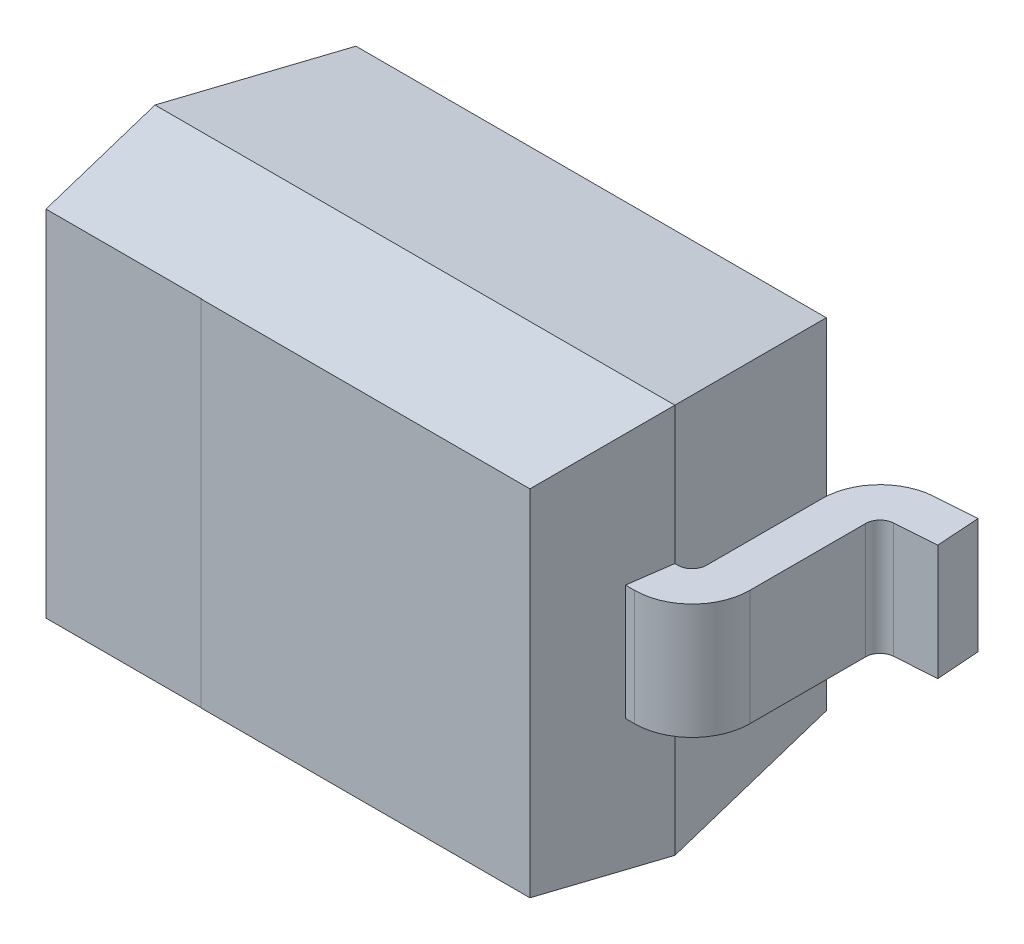
ISO-10303-21;
HEADER;
FILE_DESCRIPTION(('STEP AP214'),'2;1');
FILE_NAME('part.step','',(''),(''),'','','');
FILE_SCHEMA(('AUTOMOTIVE_DESIGN { 1 0 10303 214 1 1 1 1 }'));
ENDSEC;
DATA;
#1=APPLICATION_CONTEXT('core data for automotive mechanical design processes');
#2=APPLICATION_PROTOCOL_DEFINITION('international standard','automotive_design',2000,#1);
#3=PRODUCT_CONTEXT('',#1,'mechanical');
#4=PRODUCT('Part','Part','',(#3));
#5=PRODUCT_RELATED_PRODUCT_CATEGORY('part','',(#4));
#6=PRODUCT_DEFINITION_FORMATION('','',#4);
#7=PRODUCT_DEFINITION_CONTEXT('part definition',#1,'design');
#8=PRODUCT_DEFINITION('design','',#6,#7);
#9=PRODUCT_DEFINITION_SHAPE('','',#8);
#10=(LENGTH_UNIT() NAMED_UNIT(*) SI_UNIT(.MILLI.,.METRE.));
#11=(NAMED_UNIT(*) PLANE_ANGLE_UNIT() SI_UNIT($,.RADIAN.));
#12=(NAMED_UNIT(*) SI_UNIT($,.STERADIAN.) SOLID_ANGLE_UNIT());
#13=UNCERTAINTY_MEASURE_WITH_UNIT(LENGTH_MEASURE(1.E-05),#10,'distance_accuracy_value','');
#14=(GEOMETRIC_REPRESENTATION_CONTEXT(3) GLOBAL_UNCERTAINTY_ASSIGNED_CONTEXT((#13)) GLOBAL_UNIT_ASSIGNED_CONTEXT((#10,
#11,#12)) REPRESENTATION_CONTEXT('',''));
#15=CARTESIAN_POINT('',(0.,0.,0.));
#16=DIRECTION('',(0.,0.,1.));
#17=DIRECTION('',(1.,0.,0.));
#18=AXIS2_PLACEMENT_3D('',#15,#16,#17);
#19=CARTESIAN_POINT('',(0.,0.,1.099));
#20=DIRECTION('',(0.,0.,-1.));
#21=DIRECTION('',(0.,-1.,0.));
#22=AXIS2_PLACEMENT_3D('',#19,#20,#21);
#23=PLANE('',#22);
#24=DIRECTION('',(-1.,0.,0.));
#25=VECTOR('',#24,1.);
#26=CARTESIAN_POINT('',(-0.9,0.613302573566,1.099));
#27=LINE('',#26,#25);
#28=CARTESIAN_POINT('',(-0.3,0.613302573566,1.099));
#29=VERTEX_POINT('',#28);
#30=CARTESIAN_POINT('',(-0.838302573566,0.613302573566,1.099));
#31=VERTEX_POINT('',#30);
#32=EDGE_CURVE('E421',#29,#31,#27,.T.);
#33=ORIENTED_EDGE('',*,*,#32,.T.);
#34=DIRECTION('',(0.,1.,0.));
#35=VECTOR('',#34,1.);
#36=CARTESIAN_POINT('',(-0.838302573566,2.5,1.099));
#37=LINE('',#36,#35);
#38=CARTESIAN_POINT('',(-0.838302573566,-0.613302573566,1.099));
#39=VERTEX_POINT('',#38);
#40=EDGE_CURVE('E346',#39,#31,#37,.T.);
#41=ORIENTED_EDGE('',*,*,#40,.F.);
#42=DIRECTION('',(1.,0.,0.));
#43=VECTOR('',#42,1.);
#44=CARTESIAN_POINT('',(-0.9,-0.613302573566,1.099));
#45=LINE('',#44,#43);
#46=CARTESIAN_POINT('',(-0.3,-0.613302573566,1.099));
#47=VERTEX_POINT('',#46);
#48=EDGE_CURVE('E355',#39,#47,#45,.T.);
#49=ORIENTED_EDGE('',*,*,#48,.T.);
#50=DIRECTION('',(0.,1.,0.));
#51=VECTOR('',#50,1.);
#52=CARTESIAN_POINT('',(-0.3,0.675,1.099));
#53=LINE('',#52,#51);
#54=EDGE_CURVE('E11',#47,#29,#53,.T.);
#55=ORIENTED_EDGE('',*,*,#54,.T.);
#56=EDGE_LOOP('',(#33,#41,#49,#55));
#57=FACE_BOUND('',#56,.T.);
#58=ADVANCED_FACE('F17',(#57),#23,.F.);
#59=CARTESIAN_POINT('',(-0.3,0.675,1.099));
#60=DIRECTION('',(1.,0.,0.));
#61=DIRECTION('',(0.,1.,0.));
#62=AXIS2_PLACEMENT_3D('',#59,#60,#61);
#63=PLANE('',#62);
#64=DIRECTION('',(0.,0.139173100959942,-0.990268068741588));
#65=VECTOR('',#64,1.);
#66=CARTESIAN_POINT('',(-0.3,0.613162032731,1.1));
#67=LINE('',#66,#65);
#68=CARTESIAN_POINT('',(-0.3,0.613162032731,1.1));
#69=VERTEX_POINT('',#68);
#70=EDGE_CURVE('E411',#69,#29,#67,.T.);
#71=ORIENTED_EDGE('',*,*,#70,.T.);
#72=ORIENTED_EDGE('',*,*,#54,.F.);
#73=DIRECTION('',(0.,0.139173100959942,0.990268068741588));
#74=VECTOR('',#73,1.);
#75=CARTESIAN_POINT('',(-0.3,-0.675,0.66));
#76=LINE('',#75,#74);
#77=CARTESIAN_POINT('',(-0.3,-0.613162032731,1.1));
#78=VERTEX_POINT('',#77);
#79=EDGE_CURVE('E360',#47,#78,#76,.T.);
#80=ORIENTED_EDGE('',*,*,#79,.T.);
#81=DIRECTION('',(0.,1.,0.));
#82=VECTOR('',#81,1.);
#83=CARTESIAN_POINT('',(-0.3,0.675,1.1));
#84=LINE('',#83,#82);
#85=EDGE_CURVE('E384',#78,#69,#84,.T.);
#86=ORIENTED_EDGE('',*,*,#85,.T.);
#87=EDGE_LOOP('',(#71,#72,#80,#86));
#88=FACE_BOUND('',#87,.T.);
#89=ADVANCED_FACE('F917',(#88),#63,.F.);
#90=CARTESIAN_POINT('',(0.91,-0.2,0.61));
#91=DIRECTION('',(0.,-1.,0.));
#92=DIRECTION('',(0.,0.,-1.));
#93=AXIS2_PLACEMENT_3D('',#90,#91,#92);
#94=PLANE('',#93);
#95=DIRECTION('',(-1.,0.,0.));
#96=VECTOR('',#95,1.);
#97=CARTESIAN_POINT('',(0.91,-0.2,0.81));
#98=LINE('',#97,#96);
#99=CARTESIAN_POINT('',(0.91,-0.2,0.81));
#100=VERTEX_POINT('',#99);
#101=CARTESIAN_POINT('',(0.878918874795,-0.2,0.81));
#102=VERTEX_POINT('',#101);
#103=EDGE_CURVE('E434',#100,#102,#98,.T.);
#104=ORIENTED_EDGE('',*,*,#103,.T.);
#105=DIRECTION('',(0.139173100959942,0.,-0.990268068741588));
#106=VECTOR('',#105,1.);
#107=CARTESIAN_POINT('',(0.878918874795,-0.2,0.81));
#108=LINE('',#107,#106);
#109=CARTESIAN_POINT('',(0.9,-0.2,0.66));
#110=VERTEX_POINT('',#109);
#111=EDGE_CURVE('E1195',#102,#110,#108,.T.);
#112=ORIENTED_EDGE('',*,*,#111,.T.);
#113=DIRECTION('',(1.,0.,0.));
#114=VECTOR('',#113,1.);
#115=CARTESIAN_POINT('',(0.9,-0.2,0.66));
#116=LINE('',#115,#114);
#117=CARTESIAN_POINT('',(0.91,-0.2,0.66));
#118=VERTEX_POINT('',#117);
#119=EDGE_CURVE('E20',#110,#118,#116,.T.);
#120=ORIENTED_EDGE('',*,*,#119,.T.);
#121=CARTESIAN_POINT('',(0.91,-0.2,0.61));
#122=DIRECTION('',(0.,1.,0.));
#123=DIRECTION('',(0.,0.,-1.));
#124=AXIS2_PLACEMENT_3D('',#121,#122,#123);
#125=CIRCLE('',#124,0.05);
#126=CARTESIAN_POINT('',(0.96,-0.2,0.61));
#127=VERTEX_POINT('',#126);
#128=EDGE_CURVE('E493',#118,#127,#125,.T.);
#129=ORIENTED_EDGE('',*,*,#128,.T.);
#130=DIRECTION('',(0.,0.,-1.));
#131=VECTOR('',#130,1.);
#132=CARTESIAN_POINT('',(0.96,-0.2,0.61));
#133=LINE('',#132,#131);
#134=CARTESIAN_POINT('',(0.96,-0.2,0.209546456115));
#135=VERTEX_POINT('',#134);
#136=EDGE_CURVE('E572',#127,#135,#133,.T.);
#137=ORIENTED_EDGE('',*,*,#136,.T.);
#138=CARTESIAN_POINT('',(1.16,-0.2,0.209546456115));
#139=DIRECTION('',(0.,-1.,0.));
#140=DIRECTION('',(0.,0.,1.));
#141=AXIS2_PLACEMENT_3D('',#138,#139,#140);
#142=CIRCLE('',#141,0.2);
#143=CARTESIAN_POINT('',(1.146048705251,-0.2,0.01003364606316));
#144=VERTEX_POINT('',#143);
#145=EDGE_CURVE('E501',#135,#144,#142,.T.);
#146=ORIENTED_EDGE('',*,*,#145,.T.);
#147=DIRECTION('',(0.997564050259826,0.,-0.0697564737441078));
#148=VECTOR('',#147,1.);
#149=CARTESIAN_POINT('',(1.146048705251,-0.2,0.01003364606316));
#150=LINE('',#149,#148);
#151=CARTESIAN_POINT('',(1.289536528938,-0.2,0.));
#152=VERTEX_POINT('',#151);
#153=EDGE_CURVE('E422',#144,#152,#150,.T.);
#154=ORIENTED_EDGE('',*,*,#153,.T.);
#155=DIRECTION('',(0.0697564737441078,0.,0.997564050259826));
#156=VECTOR('',#155,1.);
#157=CARTESIAN_POINT('',(1.289536528938,-0.2,0.));
#158=LINE('',#157,#156);
#159=CARTESIAN_POINT('',(1.3,-0.2,0.149634607539));
#160=VERTEX_POINT('',#159);
#161=EDGE_CURVE('E395',#152,#160,#158,.T.);
#162=ORIENTED_EDGE('',*,*,#161,.T.);
#163=DIRECTION('',(-0.997564050259826,0.,0.0697564737441078));
#164=VECTOR('',#163,1.);
#165=CARTESIAN_POINT('',(1.3,-0.2,0.149634607539));
#166=LINE('',#165,#164);
#167=CARTESIAN_POINT('',(1.156512176313,-0.2,0.159668253602));
#168=VERTEX_POINT('',#167);
#169=EDGE_CURVE('E377',#160,#168,#166,.T.);
#170=ORIENTED_EDGE('',*,*,#169,.T.);
#171=CARTESIAN_POINT('',(1.16,-0.2,0.209546456115));
#172=DIRECTION('',(0.,1.,0.));
#173=DIRECTION('',(0.,0.,-1.));
#174=AXIS2_PLACEMENT_3D('',#171,#172,#173);
#175=CIRCLE('',#174,0.05);
#176=CARTESIAN_POINT('',(1.11,-0.2,0.209546456115));
#177=VERTEX_POINT('',#176);
#178=EDGE_CURVE('E401',#168,#177,#175,.T.);
#179=ORIENTED_EDGE('',*,*,#178,.T.);
#180=DIRECTION('',(0.,0.,1.));
#181=VECTOR('',#180,1.);
#182=CARTESIAN_POINT('',(1.11,-0.2,0.209546456115));
#183=LINE('',#182,#181);
#184=CARTESIAN_POINT('',(1.11,-0.2,0.61));
#185=VERTEX_POINT('',#184);
#186=EDGE_CURVE('E583',#177,#185,#183,.T.);
#187=ORIENTED_EDGE('',*,*,#186,.T.);
#188=CARTESIAN_POINT('',(0.91,-0.2,0.61));
#189=DIRECTION('',(0.,-1.,0.));
#190=DIRECTION('',(0.,0.,1.));
#191=AXIS2_PLACEMENT_3D('',#188,#189,#190);
#192=CIRCLE('',#191,0.2);
#193=EDGE_CURVE('E470',#185,#100,#192,.T.);
#194=ORIENTED_EDGE('',*,*,#193,.T.);
#195=EDGE_LOOP('',(#104,#112,#120,#129,#137,#146,#154,#162,#170,#179,#187,#194));
#196=FACE_BOUND('',#195,.T.);
#197=ADVANCED_FACE('F906',(#196),#94,.T.);
#198=CARTESIAN_POINT('',(0.91,0.2,0.61));
#199=DIRECTION('',(0.,-1.,0.));
#200=DIRECTION('',(0.,0.,-1.));
#201=AXIS2_PLACEMENT_3D('',#198,#199,#200);
#202=PLANE('',#201);
#203=DIRECTION('',(-1.,0.,0.));
#204=VECTOR('',#203,1.);
#205=CARTESIAN_POINT('',(0.91,0.2,0.81));
#206=LINE('',#205,#204);
#207=CARTESIAN_POINT('',(0.91,0.2,0.81));
#208=VERTEX_POINT('',#207);
#209=CARTESIAN_POINT('',(0.878918874795,0.2,0.81));
#210=VERTEX_POINT('',#209);
#211=EDGE_CURVE('E560',#208,#210,#206,.T.);
#212=ORIENTED_EDGE('',*,*,#211,.F.);
#213=CARTESIAN_POINT('',(0.91,0.2,0.61));
#214=DIRECTION('',(0.,-1.,0.));
#215=DIRECTION('',(0.,0.,1.));
#216=AXIS2_PLACEMENT_3D('',#213,#214,#215);
#217=CIRCLE('',#216,0.2);
#218=CARTESIAN_POINT('',(1.11,0.2,0.61));
#219=VERTEX_POINT('',#218);
#220=EDGE_CURVE('E469',#219,#208,#217,.T.);
#221=ORIENTED_EDGE('',*,*,#220,.F.);
#222=DIRECTION('',(0.,0.,1.));
#223=VECTOR('',#222,1.);
#224=CARTESIAN_POINT('',(1.11,0.2,0.209546456115));
#225=LINE('',#224,#223);
#226=CARTESIAN_POINT('',(1.11,0.2,0.209546456115));
#227=VERTEX_POINT('',#226);
#228=EDGE_CURVE('E404',#227,#219,#225,.T.);
#229=ORIENTED_EDGE('',*,*,#228,.F.);
#230=CARTESIAN_POINT('',(1.16,0.2,0.209546456115));
#231=DIRECTION('',(0.,1.,0.));
#232=DIRECTION('',(0.,0.,-1.));
#233=AXIS2_PLACEMENT_3D('',#230,#231,#232);
#234=CIRCLE('',#233,0.05);
#235=CARTESIAN_POINT('',(1.156512176313,0.2,0.159668253602));
#236=VERTEX_POINT('',#235);
#237=EDGE_CURVE('E374',#236,#227,#234,.T.);
#238=ORIENTED_EDGE('',*,*,#237,.F.);
#239=DIRECTION('',(-0.997564050259826,0.,0.0697564737441078));
#240=VECTOR('',#239,1.);
#241=CARTESIAN_POINT('',(1.3,0.2,0.149634607539));
#242=LINE('',#241,#240);
#243=CARTESIAN_POINT('',(1.3,0.2,0.149634607539));
#244=VERTEX_POINT('',#243);
#245=EDGE_CURVE('E392',#244,#236,#242,.T.);
#246=ORIENTED_EDGE('',*,*,#245,.F.);
#247=DIRECTION('',(0.0697564737441078,0.,0.997564050259826));
#248=VECTOR('',#247,1.);
#249=CARTESIAN_POINT('',(1.289536528938,0.2,0.));
#250=LINE('',#249,#248);
#251=CARTESIAN_POINT('',(1.289536528938,0.2,0.));
#252=VERTEX_POINT('',#251);
#253=EDGE_CURVE('E426',#252,#244,#250,.T.);
#254=ORIENTED_EDGE('',*,*,#253,.F.);
#255=DIRECTION('',(0.997564050259826,0.,-0.0697564737441078));
#256=VECTOR('',#255,1.);
#257=CARTESIAN_POINT('',(1.146048705251,0.2,0.01003364606316));
#258=LINE('',#257,#256);
#259=CARTESIAN_POINT('',(1.146048705251,0.2,0.01003364606316));
#260=VERTEX_POINT('',#259);
#261=EDGE_CURVE('E498',#260,#252,#258,.T.);
#262=ORIENTED_EDGE('',*,*,#261,.F.);
#263=CARTESIAN_POINT('',(1.16,0.2,0.209546456115));
#264=DIRECTION('',(0.,-1.,0.));
#265=DIRECTION('',(0.,0.,1.));
#266=AXIS2_PLACEMENT_3D('',#263,#264,#265);
#267=CIRCLE('',#266,0.2);
#268=CARTESIAN_POINT('',(0.96,0.2,0.209546456115));
#269=VERTEX_POINT('',#268);
#270=EDGE_CURVE('E604',#269,#260,#267,.T.);
#271=ORIENTED_EDGE('',*,*,#270,.F.);
#272=DIRECTION('',(0.,0.,-1.));
#273=VECTOR('',#272,1.);
#274=CARTESIAN_POINT('',(0.96,0.2,0.61));
#275=LINE('',#274,#273);
#276=CARTESIAN_POINT('',(0.96,0.2,0.61));
#277=VERTEX_POINT('',#276);
#278=EDGE_CURVE('E497',#277,#269,#275,.T.);
#279=ORIENTED_EDGE('',*,*,#278,.F.);
#280=CARTESIAN_POINT('',(0.91,0.2,0.61));
#281=DIRECTION('',(0.,1.,0.));
#282=DIRECTION('',(0.,0.,-1.));
#283=AXIS2_PLACEMENT_3D('',#280,#281,#282);
#284=CIRCLE('',#283,0.05);
#285=CARTESIAN_POINT('',(0.91,0.2,0.66));
#286=VERTEX_POINT('',#285);
#287=EDGE_CURVE('E547',#286,#277,#284,.T.);
#288=ORIENTED_EDGE('',*,*,#287,.F.);
#289=DIRECTION('',(1.,0.,0.));
#290=VECTOR('',#289,1.);
#291=CARTESIAN_POINT('',(0.9,0.2,0.66));
#292=LINE('',#291,#290);
#293=CARTESIAN_POINT('',(0.9,0.2,0.66));
#294=VERTEX_POINT('',#293);
#295=EDGE_CURVE('E26',#294,#286,#292,.T.);
#296=ORIENTED_EDGE('',*,*,#295,.F.);
#297=DIRECTION('',(0.139173100959942,0.,-0.990268068741588));
#298=VECTOR('',#297,1.);
#299=CARTESIAN_POINT('',(0.878918874795,0.2,0.81));
#300=LINE('',#299,#298);
#301=EDGE_CURVE('E1178',#210,#294,#300,.T.);
#302=ORIENTED_EDGE('',*,*,#301,.F.);
#303=EDGE_LOOP('',(#212,#221,#229,#238,#246,#254,#262,#271,#279,#288,#296,#302));
#304=FACE_BOUND('',#303,.T.);
#305=ADVANCED_FACE('F896',(#304),#202,.F.);
#306=CARTESIAN_POINT('',(0.9,0.2,0.66));
#307=DIRECTION('',(0.,0.,-1.));
#308=DIRECTION('',(-1.,0.,0.));
#309=AXIS2_PLACEMENT_3D('',#306,#307,#308);
#310=PLANE('',#309);
#311=ORIENTED_EDGE('',*,*,#119,.F.);
#312=DIRECTION('',(0.,-1.,0.));
#313=VECTOR('',#312,1.);
#314=CARTESIAN_POINT('',(0.9,0.2,0.66));
#315=LINE('',#314,#313);
#316=EDGE_CURVE('E407',#294,#110,#315,.T.);
#317=ORIENTED_EDGE('',*,*,#316,.F.);
#318=ORIENTED_EDGE('',*,*,#295,.T.);
#319=DIRECTION('',(0.,-1.,0.));
#320=VECTOR('',#319,1.);
#321=CARTESIAN_POINT('',(0.91,0.2,0.66));
#322=LINE('',#321,#320);
#323=EDGE_CURVE('E496',#286,#118,#322,.T.);
#324=ORIENTED_EDGE('',*,*,#323,.T.);
#325=EDGE_LOOP('',(#311,#317,#318,#324));
#326=FACE_BOUND('',#325,.T.);
#327=ADVANCED_FACE('F886',(#326),#310,.T.);
#328=CARTESIAN_POINT('',(0.91,0.2,0.61));
#329=DIRECTION('',(0.,-1.,0.));
#330=DIRECTION('',(0.,0.,-1.));
#331=AXIS2_PLACEMENT_3D('',#328,#329,#330);
#332=CYLINDRICAL_SURFACE('',#331,0.05);
#333=ORIENTED_EDGE('',*,*,#128,.F.);
#334=ORIENTED_EDGE('',*,*,#323,.F.);
#335=ORIENTED_EDGE('',*,*,#287,.T.);
#336=DIRECTION('',(0.,-1.,0.));
#337=VECTOR('',#336,1.);
#338=CARTESIAN_POINT('',(0.96,0.2,0.61));
#339=LINE('',#338,#337);
#340=EDGE_CURVE('E568',#277,#127,#339,.T.);
#341=ORIENTED_EDGE('',*,*,#340,.T.);
#342=EDGE_LOOP('',(#333,#334,#335,#341));
#343=FACE_BOUND('',#342,.T.);
#344=ADVANCED_FACE('F875',(#343),#332,.F.);
#345=CARTESIAN_POINT('',(0.96,0.2,0.61));
#346=DIRECTION('',(-1.,0.,0.));
#347=DIRECTION('',(0.,0.,1.));
#348=AXIS2_PLACEMENT_3D('',#345,#346,#347);
#349=PLANE('',#348);
#350=ORIENTED_EDGE('',*,*,#136,.F.);
#351=ORIENTED_EDGE('',*,*,#340,.F.);
#352=ORIENTED_EDGE('',*,*,#278,.T.);
#353=DIRECTION('',(0.,-1.,0.));
#354=VECTOR('',#353,1.);
#355=CARTESIAN_POINT('',(0.96,0.2,0.209546456115));
#356=LINE('',#355,#354);
#357=EDGE_CURVE('E598',#269,#135,#356,.T.);
#358=ORIENTED_EDGE('',*,*,#357,.T.);
#359=EDGE_LOOP('',(#350,#351,#352,#358));
#360=FACE_BOUND('',#359,.T.);
#361=ADVANCED_FACE('F864',(#360),#349,.T.);
#362=CARTESIAN_POINT('',(1.16,0.2,0.209546456115));
#363=DIRECTION('',(0.,-1.,0.));
#364=DIRECTION('',(0.,0.,-1.));
#365=AXIS2_PLACEMENT_3D('',#362,#363,#364);
#366=CYLINDRICAL_SURFACE('',#365,0.2);
#367=ORIENTED_EDGE('',*,*,#145,.F.);
#368=ORIENTED_EDGE('',*,*,#357,.F.);
#369=ORIENTED_EDGE('',*,*,#270,.T.);
#370=DIRECTION('',(0.,-1.,0.));
#371=VECTOR('',#370,1.);
#372=CARTESIAN_POINT('',(1.146048705251,0.2,0.01003364606316));
#373=LINE('',#372,#371);
#374=EDGE_CURVE('E425',#260,#144,#373,.T.);
#375=ORIENTED_EDGE('',*,*,#374,.T.);
#376=EDGE_LOOP('',(#367,#368,#369,#375));
#377=FACE_BOUND('',#376,.T.);
#378=ADVANCED_FACE('F853',(#377),#366,.T.);
#379=CARTESIAN_POINT('',(1.146048705251,0.2,0.01003364606316));
#380=DIRECTION('',(-0.0697564737441078,0.,-0.997564050259826));
#381=DIRECTION('',(-0.997564050259826,0.,0.0697564737441078));
#382=AXIS2_PLACEMENT_3D('',#379,#380,#381);
#383=PLANE('',#382);
#384=ORIENTED_EDGE('',*,*,#153,.F.);
#385=ORIENTED_EDGE('',*,*,#374,.F.);
#386=ORIENTED_EDGE('',*,*,#261,.T.);
#387=DIRECTION('',(0.,-1.,0.));
#388=VECTOR('',#387,1.);
#389=CARTESIAN_POINT('',(1.289536528938,0.2,0.));
#390=LINE('',#389,#388);
#391=EDGE_CURVE('E431',#252,#152,#390,.T.);
#392=ORIENTED_EDGE('',*,*,#391,.T.);
#393=EDGE_LOOP('',(#384,#385,#386,#392));
#394=FACE_BOUND('',#393,.T.);
#395=ADVANCED_FACE('F842',(#394),#383,.T.);
#396=CARTESIAN_POINT('',(1.289536528938,0.2,0.));
#397=DIRECTION('',(0.997564050259826,0.,-0.0697564737441078));
#398=DIRECTION('',(0.,-1.,0.));
#399=AXIS2_PLACEMENT_3D('',#396,#397,#398);
#400=PLANE('',#399);
#401=ORIENTED_EDGE('',*,*,#161,.F.);
#402=ORIENTED_EDGE('',*,*,#391,.F.);
#403=ORIENTED_EDGE('',*,*,#253,.T.);
#404=DIRECTION('',(0.,-1.,0.));
#405=VECTOR('',#404,1.);
#406=CARTESIAN_POINT('',(1.3,0.2,0.149634607539));
#407=LINE('',#406,#405);
#408=EDGE_CURVE('E396',#244,#160,#407,.T.);
#409=ORIENTED_EDGE('',*,*,#408,.T.);
#410=EDGE_LOOP('',(#401,#402,#403,#409));
#411=FACE_BOUND('',#410,.T.);
#412=ADVANCED_FACE('F831',(#411),#400,.T.);
#413=CARTESIAN_POINT('',(1.3,0.2,0.149634607539));
#414=DIRECTION('',(0.0697564737441078,0.,0.997564050259826));
#415=DIRECTION('',(0.,-1.,0.));
#416=AXIS2_PLACEMENT_3D('',#413,#414,#415);
#417=PLANE('',#416);
#418=ORIENTED_EDGE('',*,*,#169,.F.);
#419=ORIENTED_EDGE('',*,*,#408,.F.);
#420=ORIENTED_EDGE('',*,*,#245,.T.);
#421=DIRECTION('',(0.,-1.,0.));
#422=VECTOR('',#421,1.);
#423=CARTESIAN_POINT('',(1.156512176313,0.2,0.159668253602));
#424=LINE('',#423,#422);
#425=EDGE_CURVE('E378',#236,#168,#424,.T.);
#426=ORIENTED_EDGE('',*,*,#425,.T.);
#427=EDGE_LOOP('',(#418,#419,#420,#426));
#428=FACE_BOUND('',#427,.T.);
#429=ADVANCED_FACE('F820',(#428),#417,.T.);
#430=CARTESIAN_POINT('',(1.16,0.2,0.209546456115));
#431=DIRECTION('',(0.,-1.,0.));
#432=DIRECTION('',(0.,0.,-1.));
#433=AXIS2_PLACEMENT_3D('',#430,#431,#432);
#434=CYLINDRICAL_SURFACE('',#433,0.05);
#435=ORIENTED_EDGE('',*,*,#178,.F.);
#436=ORIENTED_EDGE('',*,*,#425,.F.);
#437=ORIENTED_EDGE('',*,*,#237,.T.);
#438=DIRECTION('',(0.,-1.,0.));
#439=VECTOR('',#438,1.);
#440=CARTESIAN_POINT('',(1.11,0.2,0.209546456115));
#441=LINE('',#440,#439);
#442=EDGE_CURVE('E586',#227,#177,#441,.T.);
#443=ORIENTED_EDGE('',*,*,#442,.T.);
#444=EDGE_LOOP('',(#435,#436,#437,#443));
#445=FACE_BOUND('',#444,.T.);
#446=ADVANCED_FACE('F809',(#445),#434,.F.);
#447=CARTESIAN_POINT('',(1.11,0.2,0.209546456115));
#448=DIRECTION('',(1.,0.,0.));
#449=DIRECTION('',(0.,0.,1.));
#450=AXIS2_PLACEMENT_3D('',#447,#448,#449);
#451=PLANE('',#450);
#452=ORIENTED_EDGE('',*,*,#186,.F.);
#453=ORIENTED_EDGE('',*,*,#442,.F.);
#454=ORIENTED_EDGE('',*,*,#228,.T.);
#455=DIRECTION('',(0.,-1.,0.));
#456=VECTOR('',#455,1.);
#457=CARTESIAN_POINT('',(1.11,0.2,0.61));
#458=LINE('',#457,#456);
#459=EDGE_CURVE('E465',#219,#185,#458,.T.);
#460=ORIENTED_EDGE('',*,*,#459,.T.);
#461=EDGE_LOOP('',(#452,#453,#454,#460));
#462=FACE_BOUND('',#461,.T.);
#463=ADVANCED_FACE('F798',(#462),#451,.T.);
#464=CARTESIAN_POINT('',(0.91,0.2,0.61));
#465=DIRECTION('',(0.,-1.,0.));
#466=DIRECTION('',(0.,0.,-1.));
#467=AXIS2_PLACEMENT_3D('',#464,#465,#466);
#468=CYLINDRICAL_SURFACE('',#467,0.2);
#469=ORIENTED_EDGE('',*,*,#193,.F.);
#470=ORIENTED_EDGE('',*,*,#459,.F.);
#471=ORIENTED_EDGE('',*,*,#220,.T.);
#472=DIRECTION('',(0.,-1.,0.));
#473=VECTOR('',#472,1.);
#474=CARTESIAN_POINT('',(0.91,0.2,0.81));
#475=LINE('',#474,#473);
#476=EDGE_CURVE('E437',#208,#100,#475,.T.);
#477=ORIENTED_EDGE('',*,*,#476,.T.);
#478=EDGE_LOOP('',(#469,#470,#471,#477));
#479=FACE_BOUND('',#478,.T.);
#480=ADVANCED_FACE('F787',(#479),#468,.T.);
#481=CARTESIAN_POINT('',(0.91,0.2,0.81));
#482=DIRECTION('',(0.,0.,1.));
#483=DIRECTION('',(1.,0.,0.));
#484=AXIS2_PLACEMENT_3D('',#481,#482,#483);
#485=PLANE('',#484);
#486=ORIENTED_EDGE('',*,*,#103,.F.);
#487=ORIENTED_EDGE('',*,*,#476,.F.);
#488=ORIENTED_EDGE('',*,*,#211,.T.);
#489=DIRECTION('',(0.,-1.,0.));
#490=VECTOR('',#489,1.);
#491=CARTESIAN_POINT('',(0.878918874795,0.2,0.81));
#492=LINE('',#491,#490);
#493=EDGE_CURVE('E1202',#210,#102,#492,.T.);
#494=ORIENTED_EDGE('',*,*,#493,.T.);
#495=EDGE_LOOP('',(#486,#487,#488,#494));
#496=FACE_BOUND('',#495,.T.);
#497=ADVANCED_FACE('F777',(#496),#485,.T.);
#498=CARTESIAN_POINT('',(-0.91,-0.2,0.61));
#499=DIRECTION('',(0.,-1.,0.));
#500=DIRECTION('',(0.,0.,-1.));
#501=AXIS2_PLACEMENT_3D('',#498,#499,#500);
#502=PLANE('',#501);
#503=DIRECTION('',(1.,0.,0.));
#504=VECTOR('',#503,1.);
#505=CARTESIAN_POINT('',(-0.91,-0.2,0.81));
#506=LINE('',#505,#504);
#507=CARTESIAN_POINT('',(-0.91,-0.2,0.81));
#508=VERTEX_POINT('',#507);
#509=CARTESIAN_POINT('',(-0.878918874795,-0.2,0.81));
#510=VERTEX_POINT('',#509);
#511=EDGE_CURVE('E449',#508,#510,#506,.T.);
#512=ORIENTED_EDGE('',*,*,#511,.F.);
#513=CARTESIAN_POINT('',(-0.91,-0.2,0.61));
#514=DIRECTION('',(0.,1.,0.));
#515=DIRECTION('',(0.,0.,1.));
#516=AXIS2_PLACEMENT_3D('',#513,#514,#515);
#517=CIRCLE('',#516,0.2);
#518=CARTESIAN_POINT('',(-1.11,-0.2,0.61));
#519=VERTEX_POINT('',#518);
#520=EDGE_CURVE('E456',#519,#508,#517,.T.);
#521=ORIENTED_EDGE('',*,*,#520,.F.);
#522=DIRECTION('',(0.,0.,1.));
#523=VECTOR('',#522,1.);
#524=CARTESIAN_POINT('',(-1.11,-0.2,0.209546456115));
#525=LINE('',#524,#523);
#526=CARTESIAN_POINT('',(-1.11,-0.2,0.209546456115));
#527=VERTEX_POINT('',#526);
#528=EDGE_CURVE('E554',#527,#519,#525,.T.);
#529=ORIENTED_EDGE('',*,*,#528,.F.);
#530=CARTESIAN_POINT('',(-1.16,-0.2,0.209546456115));
#531=DIRECTION('',(0.,-1.,0.));
#532=DIRECTION('',(0.,0.,-1.));
#533=AXIS2_PLACEMENT_3D('',#530,#531,#532);
#534=CIRCLE('',#533,0.05);
#535=CARTESIAN_POINT('',(-1.156512176313,-0.2,0.159668253602));
#536=VERTEX_POINT('',#535);
#537=EDGE_CURVE('E416',#536,#527,#534,.T.);
#538=ORIENTED_EDGE('',*,*,#537,.F.);
#539=DIRECTION('',(0.997564050259826,0.,0.0697564737441078));
#540=VECTOR('',#539,1.);
#541=CARTESIAN_POINT('',(-1.3,-0.2,0.149634607539));
#542=LINE('',#541,#540);
#543=CARTESIAN_POINT('',(-1.3,-0.2,0.149634607539));
#544=VERTEX_POINT('',#543);
#545=EDGE_CURVE('E541',#544,#536,#542,.T.);
#546=ORIENTED_EDGE('',*,*,#545,.F.);
#547=DIRECTION('',(-0.0697564737441078,0.,0.997564050259826));
#548=VECTOR('',#547,1.);
#549=CARTESIAN_POINT('',(-1.289536528938,-0.2,0.));
#550=LINE('',#549,#548);
#551=CARTESIAN_POINT('',(-1.289536528938,-0.2,0.));
#552=VERTEX_POINT('',#551);
#553=EDGE_CURVE('E441',#552,#544,#550,.T.);
#554=ORIENTED_EDGE('',*,*,#553,.F.);
#555=DIRECTION('',(-0.997564050259826,0.,-0.0697564737441078));
#556=VECTOR('',#555,1.);
#557=CARTESIAN_POINT('',(-1.146048705251,-0.2,0.01003364606316));
#558=LINE('',#557,#556);
#559=CARTESIAN_POINT('',(-1.146048705251,-0.2,0.01003364606316));
#560=VERTEX_POINT('',#559);
#561=EDGE_CURVE('E510',#560,#552,#558,.T.);
#562=ORIENTED_EDGE('',*,*,#561,.F.);
#563=CARTESIAN_POINT('',(-1.16,-0.2,0.209546456115));
#564=DIRECTION('',(0.,1.,0.));
#565=DIRECTION('',(0.,0.,1.));
#566=AXIS2_PLACEMENT_3D('',#563,#564,#565);
#567=CIRCLE('',#566,0.2);
#568=CARTESIAN_POINT('',(-0.96,-0.2,0.209546456115));
#569=VERTEX_POINT('',#568);
#570=EDGE_CURVE('E513',#569,#560,#567,.T.);
#571=ORIENTED_EDGE('',*,*,#570,.F.);
#572=DIRECTION('',(0.,0.,-1.));
#573=VECTOR('',#572,1.);
#574=CARTESIAN_POINT('',(-0.96,-0.2,0.61));
#575=LINE('',#574,#573);
#576=CARTESIAN_POINT('',(-0.96,-0.2,0.61));
#577=VERTEX_POINT('',#576);
#578=EDGE_CURVE('E488',#577,#569,#575,.T.);
#579=ORIENTED_EDGE('',*,*,#578,.F.);
#580=CARTESIAN_POINT('',(-0.91,-0.2,0.61));
#581=DIRECTION('',(0.,-1.,0.));
#582=DIRECTION('',(0.,0.,-1.));
#583=AXIS2_PLACEMENT_3D('',#580,#581,#582);
#584=CIRCLE('',#583,0.05);
#585=CARTESIAN_POINT('',(-0.91,-0.2,0.66));
#586=VERTEX_POINT('',#585);
#587=EDGE_CURVE('E308',#586,#577,#584,.T.);
#588=ORIENTED_EDGE('',*,*,#587,.F.);
#589=DIRECTION('',(-1.,0.,0.));
#590=VECTOR('',#589,1.);
#591=CARTESIAN_POINT('',(-0.9,-0.2,0.66));
#592=LINE('',#591,#590);
#593=CARTESIAN_POINT('',(-0.9,-0.2,0.66));
#594=VERTEX_POINT('',#593);
#595=EDGE_CURVE('E464',#594,#586,#592,.T.);
#596=ORIENTED_EDGE('',*,*,#595,.F.);
#597=DIRECTION('',(-0.139173100959942,0.,-0.990268068741588));
#598=VECTOR('',#597,1.);
#599=CARTESIAN_POINT('',(-0.878918874795,-0.2,0.81));
#600=LINE('',#599,#598);
#601=EDGE_CURVE('E352',#510,#594,#600,.T.);
#602=ORIENTED_EDGE('',*,*,#601,.F.);
#603=EDGE_LOOP('',(#512,#521,#529,#538,#546,#554,#562,#571,#579,#588,#596,#602));
#604=FACE_BOUND('',#603,.T.);
#605=ADVANCED_FACE('F767',(#604),#502,.T.);
#606=CARTESIAN_POINT('',(-0.91,0.2,0.61));
#607=DIRECTION('',(0.,-1.,0.));
#608=DIRECTION('',(0.,0.,-1.));
#609=AXIS2_PLACEMENT_3D('',#606,#607,#608);
#610=PLANE('',#609);
#611=DIRECTION('',(1.,0.,0.));
#612=VECTOR('',#611,1.);
#613=CARTESIAN_POINT('',(-0.91,0.2,0.81));
#614=LINE('',#613,#612);
#615=CARTESIAN_POINT('',(-0.91,0.2,0.81));
#616=VERTEX_POINT('',#615);
#617=CARTESIAN_POINT('',(-0.878918874795,0.2,0.81));
#618=VERTEX_POINT('',#617);
#619=EDGE_CURVE('E328',#616,#618,#614,.T.);
#620=ORIENTED_EDGE('',*,*,#619,.T.);
#621=DIRECTION('',(-0.139173100959942,0.,-0.990268068741588));
#622=VECTOR('',#621,1.);
#623=CARTESIAN_POINT('',(-0.878918874795,0.2,0.81));
#624=LINE('',#623,#622);
#625=CARTESIAN_POINT('',(-0.9,0.2,0.66));
#626=VERTEX_POINT('',#625);
#627=EDGE_CURVE('E325',#618,#626,#624,.T.);
#628=ORIENTED_EDGE('',*,*,#627,.T.);
#629=DIRECTION('',(-1.,0.,0.));
#630=VECTOR('',#629,1.);
#631=CARTESIAN_POINT('',(-0.9,0.2,0.66));
#632=LINE('',#631,#630);
#633=CARTESIAN_POINT('',(-0.91,0.2,0.66));
#634=VERTEX_POINT('',#633);
#635=EDGE_CURVE('E296',#626,#634,#632,.T.);
#636=ORIENTED_EDGE('',*,*,#635,.T.);
#637=CARTESIAN_POINT('',(-0.91,0.2,0.61));
#638=DIRECTION('',(0.,-1.,0.));
#639=DIRECTION('',(0.,0.,-1.));
#640=AXIS2_PLACEMENT_3D('',#637,#638,#639);
#641=CIRCLE('',#640,0.05);
#642=CARTESIAN_POINT('',(-0.96,0.2,0.61));
#643=VERTEX_POINT('',#642);
#644=EDGE_CURVE('E485',#634,#643,#641,.T.);
#645=ORIENTED_EDGE('',*,*,#644,.T.);
#646=DIRECTION('',(0.,0.,-1.));
#647=VECTOR('',#646,1.);
#648=CARTESIAN_POINT('',(-0.96,0.2,0.61));
#649=LINE('',#648,#647);
#650=CARTESIAN_POINT('',(-0.96,0.2,0.209546456115));
#651=VERTEX_POINT('',#650);
#652=EDGE_CURVE('E505',#643,#651,#649,.T.);
#653=ORIENTED_EDGE('',*,*,#652,.T.);
#654=CARTESIAN_POINT('',(-1.16,0.2,0.209546456115));
#655=DIRECTION('',(0.,1.,0.));
#656=DIRECTION('',(0.,0.,1.));
#657=AXIS2_PLACEMENT_3D('',#654,#655,#656);
#658=CIRCLE('',#657,0.2);
#659=CARTESIAN_POINT('',(-1.146048705251,0.2,0.01003364606316));
#660=VERTEX_POINT('',#659);
#661=EDGE_CURVE('E519',#651,#660,#658,.T.);
#662=ORIENTED_EDGE('',*,*,#661,.T.);
#663=DIRECTION('',(-0.997564050259826,0.,-0.0697564737441078));
#664=VECTOR('',#663,1.);
#665=CARTESIAN_POINT('',(-1.146048705251,0.2,0.01003364606316));
#666=LINE('',#665,#664);
#667=CARTESIAN_POINT('',(-1.289536528938,0.2,0.));
#668=VERTEX_POINT('',#667);
#669=EDGE_CURVE('E446',#660,#668,#666,.T.);
#670=ORIENTED_EDGE('',*,*,#669,.T.);
#671=DIRECTION('',(-0.0697564737441078,0.,0.997564050259826));
#672=VECTOR('',#671,1.);
#673=CARTESIAN_POINT('',(-1.289536528938,0.2,0.));
#674=LINE('',#673,#672);
#675=CARTESIAN_POINT('',(-1.3,0.2,0.149634607539));
#676=VERTEX_POINT('',#675);
#677=EDGE_CURVE('E537',#668,#676,#674,.T.);
#678=ORIENTED_EDGE('',*,*,#677,.T.);
#679=DIRECTION('',(0.997564050259826,0.,0.0697564737441078));
#680=VECTOR('',#679,1.);
#681=CARTESIAN_POINT('',(-1.3,0.2,0.149634607539));
#682=LINE('',#681,#680);
#683=CARTESIAN_POINT('',(-1.156512176313,0.2,0.159668253602));
#684=VERTEX_POINT('',#683);
#685=EDGE_CURVE('E412',#676,#684,#682,.T.);
#686=ORIENTED_EDGE('',*,*,#685,.T.);
#687=CARTESIAN_POINT('',(-1.16,0.2,0.209546456115));
#688=DIRECTION('',(0.,-1.,0.));
#689=DIRECTION('',(0.,0.,-1.));
#690=AXIS2_PLACEMENT_3D('',#687,#688,#689);
#691=CIRCLE('',#690,0.05);
#692=CARTESIAN_POINT('',(-1.11,0.2,0.209546456115));
#693=VERTEX_POINT('',#692);
#694=EDGE_CURVE('E533',#684,#693,#691,.T.);
#695=ORIENTED_EDGE('',*,*,#694,.T.);
#696=DIRECTION('',(0.,0.,1.));
#697=VECTOR('',#696,1.);
#698=CARTESIAN_POINT('',(-1.11,0.2,0.209546456115));
#699=LINE('',#698,#697);
#700=CARTESIAN_POINT('',(-1.11,0.2,0.61));
#701=VERTEX_POINT('',#700);
#702=EDGE_CURVE('E452',#693,#701,#699,.T.);
#703=ORIENTED_EDGE('',*,*,#702,.T.);
#704=CARTESIAN_POINT('',(-0.91,0.2,0.61));
#705=DIRECTION('',(0.,1.,0.));
#706=DIRECTION('',(0.,0.,1.));
#707=AXIS2_PLACEMENT_3D('',#704,#705,#706);
#708=CIRCLE('',#707,0.2);
#709=EDGE_CURVE('E438',#701,#616,#708,.T.);
#710=ORIENTED_EDGE('',*,*,#709,.T.);
#711=EDGE_LOOP('',(#620,#628,#636,#645,#653,#662,#670,#678,#686,#695,#703,#710));
#712=FACE_BOUND('',#711,.T.);
#713=ADVANCED_FACE('F326',(#712),#610,.F.);
#714=CARTESIAN_POINT('',(-0.91,0.2,0.61));
#715=DIRECTION('',(0.,-1.,0.));
#716=DIRECTION('',(0.,0.,-1.));
#717=AXIS2_PLACEMENT_3D('',#714,#715,#716);
#718=CYLINDRICAL_SURFACE('',#717,0.2);
#719=ORIENTED_EDGE('',*,*,#520,.T.);
#720=DIRECTION('',(0.,-1.,0.));
#721=VECTOR('',#720,1.);
#722=CARTESIAN_POINT('',(-0.91,0.2,0.81));
#723=LINE('',#722,#721);
#724=EDGE_CURVE('E460',#616,#508,#723,.T.);
#725=ORIENTED_EDGE('',*,*,#724,.F.);
#726=ORIENTED_EDGE('',*,*,#709,.F.);
#727=DIRECTION('',(0.,-1.,0.));
#728=VECTOR('',#727,1.);
#729=CARTESIAN_POINT('',(-1.11,0.2,0.61));
#730=LINE('',#729,#728);
#731=EDGE_CURVE('E457',#701,#519,#730,.T.);
#732=ORIENTED_EDGE('',*,*,#731,.T.);
#733=EDGE_LOOP('',(#719,#725,#726,#732));
#734=FACE_BOUND('',#733,.T.);
#735=ADVANCED_FACE('F746',(#734),#718,.T.);
#736=CARTESIAN_POINT('',(-1.11,0.2,0.209546456115));
#737=DIRECTION('',(1.,0.,0.));
#738=DIRECTION('',(0.,0.,-1.));
#739=AXIS2_PLACEMENT_3D('',#736,#737,#738);
#740=PLANE('',#739);
#741=ORIENTED_EDGE('',*,*,#528,.T.);
#742=ORIENTED_EDGE('',*,*,#731,.F.);
#743=ORIENTED_EDGE('',*,*,#702,.F.);
#744=DIRECTION('',(0.,-1.,0.));
#745=VECTOR('',#744,1.);
#746=CARTESIAN_POINT('',(-1.11,0.2,0.209546456115));
#747=LINE('',#746,#745);
#748=EDGE_CURVE('E529',#693,#527,#747,.T.);
#749=ORIENTED_EDGE('',*,*,#748,.T.);
#750=EDGE_LOOP('',(#741,#742,#743,#749));
#751=FACE_BOUND('',#750,.T.);
#752=ADVANCED_FACE('F735',(#751),#740,.F.);
#753=CARTESIAN_POINT('',(-1.16,0.2,0.209546456115));
#754=DIRECTION('',(0.,-1.,0.));
#755=DIRECTION('',(0.,0.,-1.));
#756=AXIS2_PLACEMENT_3D('',#753,#754,#755);
#757=CYLINDRICAL_SURFACE('',#756,0.05);
#758=ORIENTED_EDGE('',*,*,#537,.T.);
#759=ORIENTED_EDGE('',*,*,#748,.F.);
#760=ORIENTED_EDGE('',*,*,#694,.F.);
#761=DIRECTION('',(0.,-1.,0.));
#762=VECTOR('',#761,1.);
#763=CARTESIAN_POINT('',(-1.156512176313,0.2,0.159668253602));
#764=LINE('',#763,#762);
#765=EDGE_CURVE('E417',#684,#536,#764,.T.);
#766=ORIENTED_EDGE('',*,*,#765,.T.);
#767=EDGE_LOOP('',(#758,#759,#760,#766));
#768=FACE_BOUND('',#767,.T.);
#769=ADVANCED_FACE('F724',(#768),#757,.F.);
#770=CARTESIAN_POINT('',(-1.3,0.2,0.149634607539));
#771=DIRECTION('',(0.0697564737441078,0.,-0.997564050259826));
#772=DIRECTION('',(0.,-1.,0.));
#773=AXIS2_PLACEMENT_3D('',#770,#771,#772);
#774=PLANE('',#773);
#775=ORIENTED_EDGE('',*,*,#545,.T.);
#776=ORIENTED_EDGE('',*,*,#765,.F.);
#777=ORIENTED_EDGE('',*,*,#685,.F.);
#778=DIRECTION('',(0.,-1.,0.));
#779=VECTOR('',#778,1.);
#780=CARTESIAN_POINT('',(-1.3,0.2,0.149634607539));
#781=LINE('',#780,#779);
#782=EDGE_CURVE('E445',#676,#544,#781,.T.);
#783=ORIENTED_EDGE('',*,*,#782,.T.);
#784=EDGE_LOOP('',(#775,#776,#777,#783));
#785=FACE_BOUND('',#784,.T.);
#786=ADVANCED_FACE('F713',(#785),#774,.F.);
#787=CARTESIAN_POINT('',(-1.289536528938,0.2,0.));
#788=DIRECTION('',(0.997564050259826,0.,0.0697564737441078));
#789=DIRECTION('',(0.,-1.,0.));
#790=AXIS2_PLACEMENT_3D('',#787,#788,#789);
#791=PLANE('',#790);
#792=ORIENTED_EDGE('',*,*,#553,.T.);
#793=ORIENTED_EDGE('',*,*,#782,.F.);
#794=ORIENTED_EDGE('',*,*,#677,.F.);
#795=DIRECTION('',(0.,-1.,0.));
#796=VECTOR('',#795,1.);
#797=CARTESIAN_POINT('',(-1.289536528938,0.2,0.));
#798=LINE('',#797,#796);
#799=EDGE_CURVE('E506',#668,#552,#798,.T.);
#800=ORIENTED_EDGE('',*,*,#799,.T.);
#801=EDGE_LOOP('',(#792,#793,#794,#800));
#802=FACE_BOUND('',#801,.T.);
#803=ADVANCED_FACE('F702',(#802),#791,.F.);
#804=CARTESIAN_POINT('',(-1.146048705251,0.2,0.01003364606316));
#805=DIRECTION('',(-0.0697564737441078,0.,0.997564050259826));
#806=DIRECTION('',(0.,1.,0.));
#807=AXIS2_PLACEMENT_3D('',#804,#805,#806);
#808=PLANE('',#807);
#809=ORIENTED_EDGE('',*,*,#561,.T.);
#810=ORIENTED_EDGE('',*,*,#799,.F.);
#811=ORIENTED_EDGE('',*,*,#669,.F.);
#812=DIRECTION('',(0.,-1.,0.));
#813=VECTOR('',#812,1.);
#814=CARTESIAN_POINT('',(-1.146048705251,0.2,0.01003364606316));
#815=LINE('',#814,#813);
#816=EDGE_CURVE('E518',#660,#560,#815,.T.);
#817=ORIENTED_EDGE('',*,*,#816,.T.);
#818=EDGE_LOOP('',(#809,#810,#811,#817));
#819=FACE_BOUND('',#818,.T.);
#820=ADVANCED_FACE('F690',(#819),#808,.F.);
#821=CARTESIAN_POINT('',(-1.16,0.2,0.209546456115));
#822=DIRECTION('',(0.,-1.,0.));
#823=DIRECTION('',(0.,0.,-1.));
#824=AXIS2_PLACEMENT_3D('',#821,#822,#823);
#825=CYLINDRICAL_SURFACE('',#824,0.2);
#826=ORIENTED_EDGE('',*,*,#570,.T.);
#827=ORIENTED_EDGE('',*,*,#816,.F.);
#828=ORIENTED_EDGE('',*,*,#661,.F.);
#829=DIRECTION('',(0.,-1.,0.));
#830=VECTOR('',#829,1.);
#831=CARTESIAN_POINT('',(-0.96,0.2,0.209546456115));
#832=LINE('',#831,#830);
#833=EDGE_CURVE('E492',#651,#569,#832,.T.);
#834=ORIENTED_EDGE('',*,*,#833,.T.);
#835=EDGE_LOOP('',(#826,#827,#828,#834));
#836=FACE_BOUND('',#835,.T.);
#837=ADVANCED_FACE('F677',(#836),#825,.T.);
#838=CARTESIAN_POINT('',(-0.96,0.2,0.61));
#839=DIRECTION('',(-1.,0.,0.));
#840=DIRECTION('',(0.,0.,1.));
#841=AXIS2_PLACEMENT_3D('',#838,#839,#840);
#842=PLANE('',#841);
#843=ORIENTED_EDGE('',*,*,#578,.T.);
#844=ORIENTED_EDGE('',*,*,#833,.F.);
#845=ORIENTED_EDGE('',*,*,#652,.F.);
#846=DIRECTION('',(0.,-1.,0.));
#847=VECTOR('',#846,1.);
#848=CARTESIAN_POINT('',(-0.96,0.2,0.61));
#849=LINE('',#848,#847);
#850=EDGE_CURVE('E478',#643,#577,#849,.T.);
#851=ORIENTED_EDGE('',*,*,#850,.T.);
#852=EDGE_LOOP('',(#843,#844,#845,#851));
#853=FACE_BOUND('',#852,.T.);
#854=ADVANCED_FACE('F664',(#853),#842,.F.);
#855=CARTESIAN_POINT('',(-0.91,0.2,0.61));
#856=DIRECTION('',(0.,-1.,0.));
#857=DIRECTION('',(0.,0.,-1.));
#858=AXIS2_PLACEMENT_3D('',#855,#856,#857);
#859=CYLINDRICAL_SURFACE('',#858,0.05);
#860=ORIENTED_EDGE('',*,*,#587,.T.);
#861=ORIENTED_EDGE('',*,*,#850,.F.);
#862=ORIENTED_EDGE('',*,*,#644,.F.);
#863=DIRECTION('',(0.,-1.,0.));
#864=VECTOR('',#863,1.);
#865=CARTESIAN_POINT('',(-0.91,0.2,0.66));
#866=LINE('',#865,#864);
#867=EDGE_CURVE('E303',#634,#586,#866,.T.);
#868=ORIENTED_EDGE('',*,*,#867,.T.);
#869=EDGE_LOOP('',(#860,#861,#862,#868));
#870=FACE_BOUND('',#869,.T.);
#871=ADVANCED_FACE('F653',(#870),#859,.F.);
#872=CARTESIAN_POINT('',(-0.9,0.2,0.66));
#873=DIRECTION('',(0.,0.,1.));
#874=DIRECTION('',(1.,0.,0.));
#875=AXIS2_PLACEMENT_3D('',#872,#873,#874);
#876=PLANE('',#875);
#877=ORIENTED_EDGE('',*,*,#595,.T.);
#878=ORIENTED_EDGE('',*,*,#867,.F.);
#879=ORIENTED_EDGE('',*,*,#635,.F.);
#880=DIRECTION('',(0.,-1.,0.));
#881=VECTOR('',#880,1.);
#882=CARTESIAN_POINT('',(-0.9,0.2,0.66));
#883=LINE('',#882,#881);
#884=EDGE_CURVE('E300',#626,#594,#883,.T.);
#885=ORIENTED_EDGE('',*,*,#884,.T.);
#886=EDGE_LOOP('',(#877,#878,#879,#885));
#887=FACE_BOUND('',#886,.T.);
#888=ADVANCED_FACE('F299',(#887),#876,.F.);
#889=CARTESIAN_POINT('',(-0.91,0.2,0.81));
#890=DIRECTION('',(0.,0.,-1.));
#891=DIRECTION('',(0.,-1.,0.));
#892=AXIS2_PLACEMENT_3D('',#889,#890,#891);
#893=PLANE('',#892);
#894=ORIENTED_EDGE('',*,*,#511,.T.);
#895=DIRECTION('',(0.,-1.,0.));
#896=VECTOR('',#895,1.);
#897=CARTESIAN_POINT('',(-0.878918874795,0.2,0.81));
#898=LINE('',#897,#896);
#899=EDGE_CURVE('E333',#618,#510,#898,.T.);
#900=ORIENTED_EDGE('',*,*,#899,.F.);
#901=ORIENTED_EDGE('',*,*,#619,.F.);
#902=ORIENTED_EDGE('',*,*,#724,.T.);
#903=EDGE_LOOP('',(#894,#900,#901,#902));
#904=FACE_BOUND('',#903,.T.);
#905=ADVANCED_FACE('F633',(#904),#893,.F.);
#906=CARTESIAN_POINT('',(-0.9,-0.589270090832,0.05));
#907=DIRECTION('',(0.,-0.990268068741588,-0.139173100959942));
#908=DIRECTION('',(0.,0.139173100959942,-0.990268068741588));
#909=AXIS2_PLACEMENT_3D('',#906,#907,#908);
#910=PLANE('',#909);
#911=DIRECTION('',(0.137844537491984,0.137844537491984,-0.980814848463889));
#912=VECTOR('',#911,1.);
#913=CARTESIAN_POINT('',(-0.755570509885,-0.530570509885,-0.367669220981));
#914=LINE('',#913,#912);
#915=CARTESIAN_POINT('',(-0.9,-0.675,0.66));
#916=VERTEX_POINT('',#915);
#917=CARTESIAN_POINT('',(-0.814270090832,-0.589270090832,0.05));
#918=VERTEX_POINT('',#917);
#919=EDGE_CURVE('E322',#916,#918,#914,.T.);
#920=ORIENTED_EDGE('',*,*,#919,.T.);
#921=DIRECTION('',(1.,0.,0.));
#922=VECTOR('',#921,1.);
#923=CARTESIAN_POINT('',(-0.9,-0.589270090832,0.05));
#924=LINE('',#923,#922);
#925=CARTESIAN_POINT('',(0.814270090832,-0.589270090832,0.05));
#926=VERTEX_POINT('',#925);
#927=EDGE_CURVE('E361',#918,#926,#924,.T.);
#928=ORIENTED_EDGE('',*,*,#927,.T.);
#929=DIRECTION('',(0.137844537491984,-0.137844537491984,0.980814848463889));
#930=VECTOR('',#929,1.);
#931=CARTESIAN_POINT('',(0.839671455061,-0.614671455061,0.230740097944));
#932=LINE('',#931,#930);
#933=CARTESIAN_POINT('',(0.9,-0.675,0.66));
#934=VERTEX_POINT('',#933);
#935=EDGE_CURVE('E391',#926,#934,#932,.T.);
#936=ORIENTED_EDGE('',*,*,#935,.T.);
#937=DIRECTION('',(1.,0.,0.));
#938=VECTOR('',#937,1.);
#939=CARTESIAN_POINT('',(-0.9,-0.675,0.66));
#940=LINE('',#939,#938);
#941=EDGE_CURVE('E359',#916,#934,#940,.T.);
#942=ORIENTED_EDGE('',*,*,#941,.F.);
#943=EDGE_LOOP('',(#920,#928,#936,#942));
#944=FACE_BOUND('',#943,.T.);
#945=ADVANCED_FACE('F639',(#944),#910,.T.);
#946=CARTESIAN_POINT('',(-0.9,-0.675,0.66));
#947=DIRECTION('',(0.,-0.990268068741588,0.139173100959942));
#948=DIRECTION('',(-1.,0.,0.));
#949=AXIS2_PLACEMENT_3D('',#946,#947,#948);
#950=PLANE('',#949);
#951=ORIENTED_EDGE('',*,*,#79,.F.);
#952=ORIENTED_EDGE('',*,*,#48,.F.);
#953=DIRECTION('',(-0.137844537491984,-0.137844537491984,-0.980814848463889));
#954=VECTOR('',#953,1.);
#955=CARTESIAN_POINT('',(-0.839671455061,-0.614671455061,1.089259902056));
#956=LINE('',#955,#954);
#957=EDGE_CURVE('E1172',#39,#916,#956,.T.);
#958=ORIENTED_EDGE('',*,*,#957,.T.);
#959=ORIENTED_EDGE('',*,*,#941,.T.);
#960=DIRECTION('',(-0.137844537491984,0.137844537491984,0.980814848463889));
#961=VECTOR('',#960,1.);
#962=CARTESIAN_POINT('',(0.779008478213,-0.554008478213,1.520899410789));
#963=LINE('',#962,#961);
#964=CARTESIAN_POINT('',(0.838162032731,-0.613162032731,1.1));
#965=VERTEX_POINT('',#964);
#966=EDGE_CURVE('E1183',#934,#965,#963,.T.);
#967=ORIENTED_EDGE('',*,*,#966,.T.);
#968=DIRECTION('',(1.,0.,0.));
#969=VECTOR('',#968,1.);
#970=CARTESIAN_POINT('',(-0.9,-0.613162032731,1.1));
#971=LINE('',#970,#969);
#972=EDGE_CURVE('E388',#78,#965,#971,.T.);
#973=ORIENTED_EDGE('',*,*,#972,.F.);
#974=EDGE_LOOP('',(#951,#952,#958,#959,#967,#973));
#975=FACE_BOUND('',#974,.T.);
#976=ADVANCED_FACE('F935',(#975),#950,.T.);
#977=CARTESIAN_POINT('',(-0.9,0.613162032731,1.1));
#978=DIRECTION('',(0.,0.990268068741588,0.139173100959942));
#979=DIRECTION('',(1.,0.,0.));
#980=AXIS2_PLACEMENT_3D('',#977,#978,#979);
#981=PLANE('',#980);
#982=ORIENTED_EDGE('',*,*,#70,.F.);
#983=DIRECTION('',(1.,0.,0.));
#984=VECTOR('',#983,1.);
#985=CARTESIAN_POINT('',(-0.9,0.613162032731,1.1));
#986=LINE('',#985,#984);
#987=CARTESIAN_POINT('',(0.838162032731,0.613162032731,1.1));
#988=VERTEX_POINT('',#987);
#989=EDGE_CURVE('E381',#69,#988,#986,.T.);
#990=ORIENTED_EDGE('',*,*,#989,.T.);
#991=DIRECTION('',(0.137844537491984,0.137844537491984,-0.980814848463889));
#992=VECTOR('',#991,1.);
#993=CARTESIAN_POINT('',(0.874014060794,0.649014060794,0.844899565031));
#994=LINE('',#993,#992);
#995=CARTESIAN_POINT('',(0.9,0.675,0.66));
#996=VERTEX_POINT('',#995);
#997=EDGE_CURVE('E1177',#988,#996,#994,.T.);
#998=ORIENTED_EDGE('',*,*,#997,.T.);
#999=DIRECTION('',(1.,0.,0.));
#1000=VECTOR('',#999,1.);
#1001=CARTESIAN_POINT('',(-0.9,0.675,0.66));
#1002=LINE('',#1001,#1000);
#1003=CARTESIAN_POINT('',(-0.9,0.675,0.66));
#1004=VERTEX_POINT('',#1003);
#1005=EDGE_CURVE('E408',#1004,#996,#1002,.T.);
#1006=ORIENTED_EDGE('',*,*,#1005,.F.);
#1007=DIRECTION('',(0.137844537491984,-0.137844537491984,0.980814848463889));
#1008=VECTOR('',#1007,1.);
#1009=CARTESIAN_POINT('',(-0.934677037642,0.709677037642,0.413260056299));
#1010=LINE('',#1009,#1008);
#1011=EDGE_CURVE('E339',#1004,#31,#1010,.T.);
#1012=ORIENTED_EDGE('',*,*,#1011,.T.);
#1013=ORIENTED_EDGE('',*,*,#32,.F.);
#1014=EDGE_LOOP('',(#982,#990,#998,#1006,#1012,#1013));
#1015=FACE_BOUND('',#1014,.T.);
#1016=ADVANCED_FACE('F939',(#1015),#981,.T.);
#1017=CARTESIAN_POINT('',(-0.9,0.675,0.66));
#1018=DIRECTION('',(0.,0.990268068741588,-0.139173100959942));
#1019=DIRECTION('',(-1.,0.,0.));
#1020=AXIS2_PLACEMENT_3D('',#1017,#1018,#1019);
#1021=PLANE('',#1020);
#1022=DIRECTION('',(-0.137844537491984,0.137844537491984,0.980814848463889));
#1023=VECTOR('',#1022,1.);
#1024=CARTESIAN_POINT('',(-0.850576092467,0.625576092467,0.308330624776));
#1025=LINE('',#1024,#1023);
#1026=CARTESIAN_POINT('',(-0.814270090832,0.589270090832,0.05));
#1027=VERTEX_POINT('',#1026);
#1028=EDGE_CURVE('E321',#1027,#1004,#1025,.T.);
#1029=ORIENTED_EDGE('',*,*,#1028,.T.);
#1030=ORIENTED_EDGE('',*,*,#1005,.T.);
#1031=DIRECTION('',(-0.137844537491984,-0.137844537491984,-0.980814848463889));
#1032=VECTOR('',#1031,1.);
#1033=CARTESIAN_POINT('',(0.934677037642,0.709677037642,0.906739943701));
#1034=LINE('',#1033,#1032);
#1035=CARTESIAN_POINT('',(0.814270090832,0.589270090832,0.05));
#1036=VERTEX_POINT('',#1035);
#1037=EDGE_CURVE('E400',#996,#1036,#1034,.T.);
#1038=ORIENTED_EDGE('',*,*,#1037,.T.);
#1039=DIRECTION('',(1.,0.,0.));
#1040=VECTOR('',#1039,1.);
#1041=CARTESIAN_POINT('',(-0.9,0.589270090832,0.05));
#1042=LINE('',#1041,#1040);
#1043=EDGE_CURVE('E369',#1027,#1036,#1042,.T.);
#1044=ORIENTED_EDGE('',*,*,#1043,.F.);
#1045=EDGE_LOOP('',(#1029,#1030,#1038,#1044));
#1046=FACE_BOUND('',#1045,.T.);
#1047=ADVANCED_FACE('F945',(#1046),#1021,.T.);
#1048=CARTESIAN_POINT('',(0.9,2.5,0.66));
#1049=DIRECTION('',(-0.990268068741588,0.,0.139173100959942));
#1050=DIRECTION('',(0.,1.,0.));
#1051=AXIS2_PLACEMENT_3D('',#1048,#1049,#1050);
#1052=PLANE('',#1051);
#1053=ORIENTED_EDGE('',*,*,#935,.F.);
#1054=DIRECTION('',(0.,-1.,0.));
#1055=VECTOR('',#1054,1.);
#1056=CARTESIAN_POINT('',(0.814270090832,2.5,0.05));
#1057=LINE('',#1056,#1055);
#1058=EDGE_CURVE('E370',#1036,#926,#1057,.T.);
#1059=ORIENTED_EDGE('',*,*,#1058,.F.);
#1060=ORIENTED_EDGE('',*,*,#1037,.F.);
#1061=DIRECTION('',(0.,-1.,0.));
#1062=VECTOR('',#1061,1.);
#1063=CARTESIAN_POINT('',(0.9,2.5,0.66));
#1064=LINE('',#1063,#1062);
#1065=EDGE_CURVE('E1173',#996,#294,#1064,.T.);
#1066=ORIENTED_EDGE('',*,*,#1065,.T.);
#1067=ORIENTED_EDGE('',*,*,#316,.T.);
#1068=DIRECTION('',(0.,-1.,0.));
#1069=VECTOR('',#1068,1.);
#1070=CARTESIAN_POINT('',(0.9,2.5,0.66));
#1071=LINE('',#1070,#1069);
#1072=EDGE_CURVE('E1155',#110,#934,#1071,.T.);
#1073=ORIENTED_EDGE('',*,*,#1072,.T.);
#1074=EDGE_LOOP('',(#1053,#1059,#1060,#1066,#1067,#1073));
#1075=FACE_BOUND('',#1074,.T.);
#1076=ADVANCED_FACE('F949',(#1075),#1052,.F.);
#1077=CARTESIAN_POINT('',(-0.838162032731,2.5,1.1));
#1078=DIRECTION('',(0.,0.,-1.));
#1079=DIRECTION('',(0.,-1.,0.));
#1080=AXIS2_PLACEMENT_3D('',#1077,#1078,#1079);
#1081=PLANE('',#1080);
#1082=ORIENTED_EDGE('',*,*,#989,.F.);
#1083=ORIENTED_EDGE('',*,*,#85,.F.);
#1084=ORIENTED_EDGE('',*,*,#972,.T.);
#1085=DIRECTION('',(0.,-1.,0.));
#1086=VECTOR('',#1085,1.);
#1087=CARTESIAN_POINT('',(0.838162032731,2.5,1.1));
#1088=LINE('',#1087,#1086);
#1089=EDGE_CURVE('E1182',#988,#965,#1088,.T.);
#1090=ORIENTED_EDGE('',*,*,#1089,.F.);
#1091=EDGE_LOOP('',(#1082,#1083,#1084,#1090));
#1092=FACE_BOUND('',#1091,.T.);
#1093=ADVANCED_FACE('F955',(#1092),#1081,.F.);
#1094=CARTESIAN_POINT('',(-0.814270090832,2.5,0.05));
#1095=DIRECTION('',(0.990268068741588,0.,0.139173100959942));
#1096=DIRECTION('',(0.,-1.,0.));
#1097=AXIS2_PLACEMENT_3D('',#1094,#1095,#1096);
#1098=PLANE('',#1097);
#1099=ORIENTED_EDGE('',*,*,#919,.F.);
#1100=DIRECTION('',(0.,-1.,0.));
#1101=VECTOR('',#1100,1.);
#1102=CARTESIAN_POINT('',(-0.9,2.5,0.66));
#1103=LINE('',#1102,#1101);
#1104=EDGE_CURVE('E318',#594,#916,#1103,.T.);
#1105=ORIENTED_EDGE('',*,*,#1104,.F.);
#1106=ORIENTED_EDGE('',*,*,#884,.F.);
#1107=DIRECTION('',(0.,-1.,0.));
#1108=VECTOR('',#1107,1.);
#1109=CARTESIAN_POINT('',(-0.9,2.5,0.66));
#1110=LINE('',#1109,#1108);
#1111=EDGE_CURVE('E315',#1004,#626,#1110,.T.);
#1112=ORIENTED_EDGE('',*,*,#1111,.F.);
#1113=ORIENTED_EDGE('',*,*,#1028,.F.);
#1114=DIRECTION('',(0.,-1.,0.));
#1115=VECTOR('',#1114,1.);
#1116=CARTESIAN_POINT('',(-0.814270090832,2.5,0.05));
#1117=LINE('',#1116,#1115);
#1118=EDGE_CURVE('E365',#1027,#918,#1117,.T.);
#1119=ORIENTED_EDGE('',*,*,#1118,.T.);
#1120=EDGE_LOOP('',(#1099,#1105,#1106,#1112,#1113,#1119));
#1121=FACE_BOUND('',#1120,.T.);
#1122=ADVANCED_FACE('F313',(#1121),#1098,.F.);
#1123=CARTESIAN_POINT('',(0.814270090832,2.5,0.05));
#1124=DIRECTION('',(0.,0.,1.));
#1125=DIRECTION('',(1.,0.,0.));
#1126=AXIS2_PLACEMENT_3D('',#1123,#1124,#1125);
#1127=PLANE('',#1126);
#1128=ORIENTED_EDGE('',*,*,#927,.F.);
#1129=ORIENTED_EDGE('',*,*,#1118,.F.);
#1130=ORIENTED_EDGE('',*,*,#1043,.T.);
#1131=ORIENTED_EDGE('',*,*,#1058,.T.);
#1132=EDGE_LOOP('',(#1128,#1129,#1130,#1131));
#1133=FACE_BOUND('',#1132,.T.);
#1134=ADVANCED_FACE('F980',(#1133),#1127,.F.);
#1135=CARTESIAN_POINT('',(-0.9,2.5,0.66));
#1136=DIRECTION('',(0.990268068741588,0.,-0.139173100959942));
#1137=DIRECTION('',(0.,-1.,0.));
#1138=AXIS2_PLACEMENT_3D('',#1135,#1136,#1137);
#1139=PLANE('',#1138);
#1140=ORIENTED_EDGE('',*,*,#957,.F.);
#1141=ORIENTED_EDGE('',*,*,#40,.T.);
#1142=ORIENTED_EDGE('',*,*,#1011,.F.);
#1143=ORIENTED_EDGE('',*,*,#1111,.T.);
#1144=ORIENTED_EDGE('',*,*,#627,.F.);
#1145=ORIENTED_EDGE('',*,*,#899,.T.);
#1146=ORIENTED_EDGE('',*,*,#601,.T.);
#1147=ORIENTED_EDGE('',*,*,#1104,.T.);
#1148=EDGE_LOOP('',(#1140,#1141,#1142,#1143,#1144,#1145,#1146,#1147));
#1149=FACE_BOUND('',#1148,.T.);
#1150=ADVANCED_FACE('F336',(#1149),#1139,.F.);
#1151=CARTESIAN_POINT('',(0.838162032731,2.5,1.1));
#1152=DIRECTION('',(-0.990268068741588,0.,-0.139173100959942));
#1153=DIRECTION('',(-0.139173100959942,0.,0.990268068741588));
#1154=AXIS2_PLACEMENT_3D('',#1151,#1152,#1153);
#1155=PLANE('',#1154);
#1156=ORIENTED_EDGE('',*,*,#301,.T.);
#1157=ORIENTED_EDGE('',*,*,#1065,.F.);
#1158=ORIENTED_EDGE('',*,*,#997,.F.);
#1159=ORIENTED_EDGE('',*,*,#1089,.T.);
#1160=ORIENTED_EDGE('',*,*,#966,.F.);
#1161=ORIENTED_EDGE('',*,*,#1072,.F.);
#1162=ORIENTED_EDGE('',*,*,#111,.F.);
#1163=ORIENTED_EDGE('',*,*,#493,.F.);
#1164=EDGE_LOOP('',(#1156,#1157,#1158,#1159,#1160,#1161,#1162,#1163));
#1165=FACE_BOUND('',#1164,.T.);
#1166=ADVANCED_FACE('F994',(#1165),#1155,.F.);
#1167=CLOSED_SHELL('',(#58,#89,#197,#305,#327,#344,#361,#378,#395,#412,#429,#446,#463,#480,#497,
#605,#713,#735,#752,#769,#786,#803,#820,#837,#854,#871,#888,#905,#945,#976,#1016,#1047,#1076,
#1093,#1122,#1134,#1150,#1166));
#1168=MANIFOLD_SOLID_BREP('B1',#1167);
#1169=ADVANCED_BREP_SHAPE_REPRESENTATION('',(#18,#1168),#14);
#1170=SHAPE_DEFINITION_REPRESENTATION(#9,#1169);
ENDSEC;
END-ISO-10303-21;
